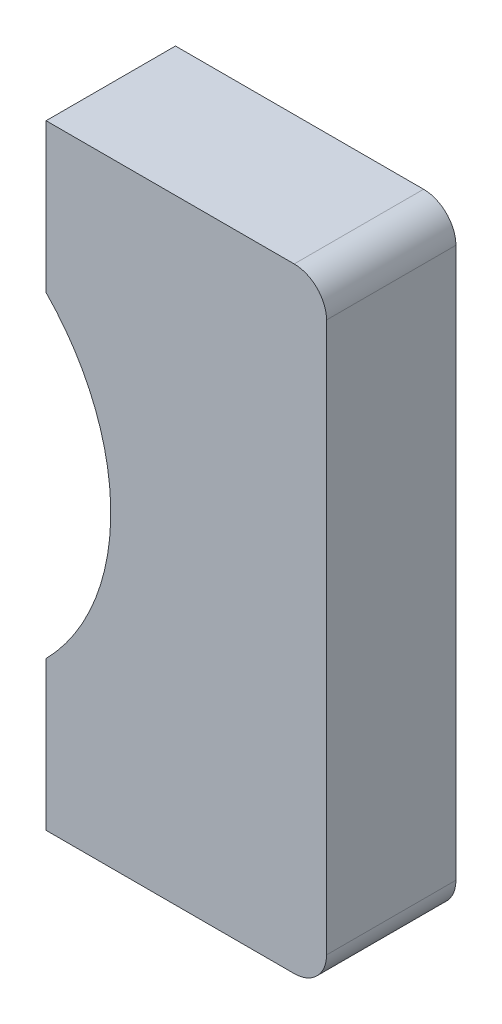
ISO-10303-21;
HEADER;
FILE_DESCRIPTION(('STEP AP214'),'2;1');
FILE_NAME('part.step','',(''),(''),'','','');
FILE_SCHEMA(('AUTOMOTIVE_DESIGN { 1 0 10303 214 1 1 1 1 }'));
ENDSEC;
DATA;
#1=APPLICATION_CONTEXT('core data for automotive mechanical design processes');
#2=APPLICATION_PROTOCOL_DEFINITION('international standard','automotive_design',2000,#1);
#3=PRODUCT_CONTEXT('',#1,'mechanical');
#4=PRODUCT('Part','Part','',(#3));
#5=PRODUCT_RELATED_PRODUCT_CATEGORY('part','',(#4));
#6=PRODUCT_DEFINITION_FORMATION('','',#4);
#7=PRODUCT_DEFINITION_CONTEXT('part definition',#1,'design');
#8=PRODUCT_DEFINITION('design','',#6,#7);
#9=PRODUCT_DEFINITION_SHAPE('','',#8);
#10=(LENGTH_UNIT() NAMED_UNIT(*) SI_UNIT(.MILLI.,.METRE.));
#11=(NAMED_UNIT(*) PLANE_ANGLE_UNIT() SI_UNIT($,.RADIAN.));
#12=(NAMED_UNIT(*) SI_UNIT($,.STERADIAN.) SOLID_ANGLE_UNIT());
#13=UNCERTAINTY_MEASURE_WITH_UNIT(LENGTH_MEASURE(1.E-05),#10,'distance_accuracy_value','');
#14=(GEOMETRIC_REPRESENTATION_CONTEXT(3) GLOBAL_UNCERTAINTY_ASSIGNED_CONTEXT((#13)) GLOBAL_UNIT_ASSIGNED_CONTEXT((#10,
#11,#12)) REPRESENTATION_CONTEXT('',''));
#15=CARTESIAN_POINT('',(0.,0.,0.));
#16=DIRECTION('',(0.,0.,1.));
#17=DIRECTION('',(1.,0.,0.));
#18=AXIS2_PLACEMENT_3D('',#15,#16,#17);
#19=CARTESIAN_POINT('',(7.21606200098991,-0.126876069111276,2.));
#20=DIRECTION('',(-1.,0.,0.));
#21=DIRECTION('',(0.,-1.,-4.37113882867379E-08));
#22=AXIS2_PLACEMENT_3D('',#19,#20,#21);
#23=PLANE('',#22);
#24=DIRECTION('',(0.,0.999999999999999,4.37113882867379E-08));
#25=VECTOR('',#24,1.);
#26=CARTESIAN_POINT('',(7.21606200098992,-4.3768759816885,-1.85773400218636E-07));
#27=LINE('',#26,#25);
#28=CARTESIAN_POINT('',(7.21606200098991,-4.3768759816885,-1.85773400218636E-07));
#29=VERTEX_POINT('',#28);
#30=CARTESIAN_POINT('',(7.21606200098991,4.1231240183115,1.85773400218636E-07));
#31=VERTEX_POINT('',#30);
#32=EDGE_CURVE('E11',#29,#31,#27,.T.);
#33=ORIENTED_EDGE('',*,*,#32,.T.);
#34=DIRECTION('',(0.,4.37113882867379E-08,-0.999999999999999));
#35=VECTOR('',#34,1.);
#36=CARTESIAN_POINT('',(7.21606200098991,4.12312393088872,2.0000001857734));
#37=LINE('',#36,#35);
#38=CARTESIAN_POINT('',(7.21606200098991,4.12312393088872,2.0000001857734));
#39=VERTEX_POINT('',#38);
#40=EDGE_CURVE('E146',#39,#31,#37,.T.);
#41=ORIENTED_EDGE('',*,*,#40,.F.);
#42=DIRECTION('',(0.,0.999999999999999,4.37113882867379E-08));
#43=VECTOR('',#42,1.);
#44=CARTESIAN_POINT('',(7.21606200098992,-4.37687606911128,1.9999998142266));
#45=LINE('',#44,#43);
#46=CARTESIAN_POINT('',(7.21606200098991,-4.37687606911128,1.9999998142266));
#47=VERTEX_POINT('',#46);
#48=EDGE_CURVE('E140',#47,#39,#45,.T.);
#49=ORIENTED_EDGE('',*,*,#48,.F.);
#50=DIRECTION('',(0.,4.37113882867379E-08,-0.999999999999999));
#51=VECTOR('',#50,1.);
#52=CARTESIAN_POINT('',(7.21606200098991,-4.37687606911128,1.9999998142266));
#53=LINE('',#52,#51);
#54=EDGE_CURVE('E97',#47,#29,#53,.T.);
#55=ORIENTED_EDGE('',*,*,#54,.T.);
#56=EDGE_LOOP('',(#33,#41,#49,#55));
#57=FACE_BOUND('',#56,.T.);
#58=ADVANCED_FACE('F17',(#57),#23,.F.);
#59=CARTESIAN_POINT('',(6.71606200098991,4.12312393088872,2.0000001857734));
#60=DIRECTION('',(0.,4.37113882867379E-08,-1.));
#61=DIRECTION('',(0.,1.,4.37113882867379E-08));
#62=AXIS2_PLACEMENT_3D('',#59,#60,#61);
#63=CYLINDRICAL_SURFACE('',#62,0.5);
#64=CARTESIAN_POINT('',(6.71606200098991,4.1231240183115,1.85773400218636E-07));
#65=DIRECTION('',(0.,-4.37113882867379E-08,1.));
#66=DIRECTION('',(1.,0.,0.));
#67=AXIS2_PLACEMENT_3D('',#64,#65,#66);
#68=CIRCLE('',#67,0.5);
#69=CARTESIAN_POINT('',(6.71606200098991,4.6231240183115,2.07629094362005E-07));
#70=VERTEX_POINT('',#69);
#71=EDGE_CURVE('E24',#31,#70,#68,.T.);
#72=ORIENTED_EDGE('',*,*,#71,.T.);
#73=DIRECTION('',(0.,4.37113882867379E-08,-0.999999999999999));
#74=VECTOR('',#73,1.);
#75=CARTESIAN_POINT('',(6.71606200098991,4.62312393088872,2.00000020762909));
#76=LINE('',#75,#74);
#77=CARTESIAN_POINT('',(6.71606200098991,4.62312393088872,2.00000020762909));
#78=VERTEX_POINT('',#77);
#79=EDGE_CURVE('E142',#78,#70,#76,.T.);
#80=ORIENTED_EDGE('',*,*,#79,.F.);
#81=CARTESIAN_POINT('',(6.71606200098991,4.12312393088872,2.0000001857734));
#82=DIRECTION('',(0.,-4.37113882867379E-08,1.));
#83=DIRECTION('',(1.,0.,0.));
#84=AXIS2_PLACEMENT_3D('',#81,#82,#83);
#85=CIRCLE('',#84,0.5);
#86=EDGE_CURVE('E132',#39,#78,#85,.T.);
#87=ORIENTED_EDGE('',*,*,#86,.F.);
#88=ORIENTED_EDGE('',*,*,#40,.T.);
#89=EDGE_LOOP('',(#72,#80,#87,#88));
#90=FACE_BOUND('',#89,.T.);
#91=ADVANCED_FACE('F148',(#90),#63,.T.);
#92=CARTESIAN_POINT('',(0.381062000989914,4.62312393088872,2.00000020762909));
#93=DIRECTION('',(0.,-1.,-4.37113882867379E-08));
#94=DIRECTION('',(1.,0.,0.));
#95=AXIS2_PLACEMENT_3D('',#92,#93,#94);
#96=PLANE('',#95);
#97=DIRECTION('',(-1.,0.,0.));
#98=VECTOR('',#97,1.);
#99=CARTESIAN_POINT('',(6.71606200098991,4.6231240183115,2.07629094362005E-07));
#100=LINE('',#99,#98);
#101=CARTESIAN_POINT('',(2.88106200098991,4.6231240183115,2.07629094362005E-07));
#102=VERTEX_POINT('',#101);
#103=EDGE_CURVE('E144',#70,#102,#100,.T.);
#104=ORIENTED_EDGE('',*,*,#103,.T.);
#105=DIRECTION('',(0.,4.37113882867379E-08,-0.999999999999999));
#106=VECTOR('',#105,1.);
#107=CARTESIAN_POINT('',(2.88106200098991,4.62312393088872,2.00000020762909));
#108=LINE('',#107,#106);
#109=CARTESIAN_POINT('',(2.88106200098991,4.62312393088872,2.00000020762909));
#110=VERTEX_POINT('',#109);
#111=EDGE_CURVE('E135',#110,#102,#108,.T.);
#112=ORIENTED_EDGE('',*,*,#111,.F.);
#113=DIRECTION('',(-1.,0.,0.));
#114=VECTOR('',#113,1.);
#115=CARTESIAN_POINT('',(6.71606200098991,4.62312393088872,2.00000020762909));
#116=LINE('',#115,#114);
#117=EDGE_CURVE('E122',#78,#110,#116,.T.);
#118=ORIENTED_EDGE('',*,*,#117,.F.);
#119=ORIENTED_EDGE('',*,*,#79,.T.);
#120=EDGE_LOOP('',(#104,#112,#118,#119));
#121=FACE_BOUND('',#120,.T.);
#122=ADVANCED_FACE('F154',(#121),#96,.F.);
#123=CARTESIAN_POINT('',(2.88106200098991,-0.126876069111276,2.));
#124=DIRECTION('',(1.,0.,0.));
#125=DIRECTION('',(0.,1.,4.37113882867379E-08));
#126=AXIS2_PLACEMENT_3D('',#123,#124,#125);
#127=PLANE('',#126);
#128=DIRECTION('',(0.,-0.999999999999999,-4.37113882867379E-08));
#129=VECTOR('',#128,1.);
#130=CARTESIAN_POINT('',(2.88106200098991,4.6231240183115,2.07629094362005E-07));
#131=LINE('',#130,#129);
#132=CARTESIAN_POINT('',(2.88106200098991,2.3226137610945,1.0707059725117E-07));
#133=VERTEX_POINT('',#132);
#134=EDGE_CURVE('E138',#102,#133,#131,.T.);
#135=ORIENTED_EDGE('',*,*,#134,.T.);
#136=DIRECTION('',(0.,4.37113882867379E-08,-0.999999999999999));
#137=VECTOR('',#136,1.);
#138=CARTESIAN_POINT('',(2.88106200098991,2.32261367367172,2.0000001070706));
#139=LINE('',#138,#137);
#140=CARTESIAN_POINT('',(2.88106200098991,2.32261367367172,2.0000001070706));
#141=VERTEX_POINT('',#140);
#142=EDGE_CURVE('E125',#141,#133,#139,.T.);
#143=ORIENTED_EDGE('',*,*,#142,.F.);
#144=DIRECTION('',(0.,-0.999999999999999,-4.37113882754165E-08));
#145=VECTOR('',#144,1.);
#146=CARTESIAN_POINT('',(2.88106200098991,4.62312393088872,2.00000020762909));
#147=LINE('',#146,#145);
#148=EDGE_CURVE('E114',#110,#141,#147,.T.);
#149=ORIENTED_EDGE('',*,*,#148,.F.);
#150=ORIENTED_EDGE('',*,*,#111,.T.);
#151=EDGE_LOOP('',(#135,#143,#149,#150));
#152=FACE_BOUND('',#151,.T.);
#153=ADVANCED_FACE('F158',(#152),#127,.F.);
#154=CARTESIAN_POINT('',(0.38106200098991,-0.126876069111276,2.));
#155=DIRECTION('',(0.,4.37113882867379E-08,-1.));
#156=DIRECTION('',(0.,1.,4.37113882867379E-08));
#157=AXIS2_PLACEMENT_3D('',#154,#155,#156);
#158=CYLINDRICAL_SURFACE('',#157,3.5);
#159=CARTESIAN_POINT('',(0.38106200098991,-0.126875981688499,0.));
#160=DIRECTION('',(0.,-4.37113882867379E-08,1.));
#161=DIRECTION('',(0.71428571428574,-0.699854212223739,-3.05915992146209E-08));
#162=AXIS2_PLACEMENT_3D('',#159,#160,#161);
#163=CIRCLE('',#162,3.5);
#164=CARTESIAN_POINT('',(2.88106200098991,-2.5763657244715,-1.0707059725117E-07));
#165=VERTEX_POINT('',#164);
#166=EDGE_CURVE('E128',#165,#133,#163,.T.);
#167=ORIENTED_EDGE('',*,*,#166,.F.);
#168=DIRECTION('',(0.,4.37113882867379E-08,-0.999999999999999));
#169=VECTOR('',#168,1.);
#170=CARTESIAN_POINT('',(2.88106200098991,-2.57636581189428,1.9999998929294));
#171=LINE('',#170,#169);
#172=CARTESIAN_POINT('',(2.88106200098991,-2.57636581189428,1.9999998929294));
#173=VERTEX_POINT('',#172);
#174=EDGE_CURVE('E117',#173,#165,#171,.T.);
#175=ORIENTED_EDGE('',*,*,#174,.F.);
#176=CARTESIAN_POINT('',(0.38106200098991,-0.126876069111276,2.));
#177=DIRECTION('',(0.,-4.37113882867379E-08,1.));
#178=DIRECTION('',(0.71428571428574,-0.699854212223739,-3.05915992146209E-08));
#179=AXIS2_PLACEMENT_3D('',#176,#177,#178);
#180=CIRCLE('',#179,3.5);
#181=EDGE_CURVE('E108',#173,#141,#180,.T.);
#182=ORIENTED_EDGE('',*,*,#181,.T.);
#183=ORIENTED_EDGE('',*,*,#142,.T.);
#184=EDGE_LOOP('',(#167,#175,#182,#183));
#185=FACE_BOUND('',#184,.T.);
#186=ADVANCED_FACE('F163',(#185),#158,.F.);
#187=CARTESIAN_POINT('',(2.88106200098991,-0.126876069111276,2.));
#188=DIRECTION('',(1.,0.,0.));
#189=DIRECTION('',(0.,1.,4.37113882867379E-08));
#190=AXIS2_PLACEMENT_3D('',#187,#188,#189);
#191=PLANE('',#190);
#192=DIRECTION('',(0.,-0.999999999999999,-4.37113882867379E-08));
#193=VECTOR('',#192,1.);
#194=CARTESIAN_POINT('',(2.88106200098991,-2.5763657244715,-1.0707059725117E-07));
#195=LINE('',#194,#193);
#196=CARTESIAN_POINT('',(2.88106200098991,-4.8768759816885,-2.07629094362005E-07));
#197=VERTEX_POINT('',#196);
#198=EDGE_CURVE('E120',#165,#197,#195,.T.);
#199=ORIENTED_EDGE('',*,*,#198,.T.);
#200=DIRECTION('',(0.,4.37113882867379E-08,-0.999999999999999));
#201=VECTOR('',#200,1.);
#202=CARTESIAN_POINT('',(2.88106200098991,-4.87687606911128,1.99999979237091));
#203=LINE('',#202,#201);
#204=CARTESIAN_POINT('',(2.88106200098991,-4.87687606911128,1.99999979237091));
#205=VERTEX_POINT('',#204);
#206=EDGE_CURVE('E111',#205,#197,#203,.T.);
#207=ORIENTED_EDGE('',*,*,#206,.F.);
#208=DIRECTION('',(0.,-0.999999999999999,-4.37113882754165E-08));
#209=VECTOR('',#208,1.);
#210=CARTESIAN_POINT('',(2.88106200098991,-2.57636581189428,1.9999998929294));
#211=LINE('',#210,#209);
#212=EDGE_CURVE('E91',#173,#205,#211,.T.);
#213=ORIENTED_EDGE('',*,*,#212,.F.);
#214=ORIENTED_EDGE('',*,*,#174,.T.);
#215=EDGE_LOOP('',(#199,#207,#213,#214));
#216=FACE_BOUND('',#215,.T.);
#217=ADVANCED_FACE('F161',(#216),#191,.F.);
#218=CARTESIAN_POINT('',(0.381062000989914,-4.87687606911128,1.99999979237091));
#219=DIRECTION('',(0.,-1.,-4.37113882867379E-08));
#220=DIRECTION('',(1.,0.,0.));
#221=AXIS2_PLACEMENT_3D('',#218,#219,#220);
#222=PLANE('',#221);
#223=DIRECTION('',(-1.,0.,0.));
#224=VECTOR('',#223,1.);
#225=CARTESIAN_POINT('',(6.71606200098991,-4.87687598168849,-2.07629094362005E-07));
#226=LINE('',#225,#224);
#227=CARTESIAN_POINT('',(6.71606200098991,-4.8768759816885,-2.07629094362005E-07));
#228=VERTEX_POINT('',#227);
#229=EDGE_CURVE('E86',#228,#197,#226,.T.);
#230=ORIENTED_EDGE('',*,*,#229,.F.);
#231=DIRECTION('',(0.,4.37113882867379E-08,-0.999999999999999));
#232=VECTOR('',#231,1.);
#233=CARTESIAN_POINT('',(6.71606200098991,-4.87687606911128,1.99999979237091));
#234=LINE('',#233,#232);
#235=CARTESIAN_POINT('',(6.71606200098991,-4.87687606911128,1.99999979237091));
#236=VERTEX_POINT('',#235);
#237=EDGE_CURVE('E78',#236,#228,#234,.T.);
#238=ORIENTED_EDGE('',*,*,#237,.F.);
#239=DIRECTION('',(-1.,0.,0.));
#240=VECTOR('',#239,1.);
#241=CARTESIAN_POINT('',(6.71606200098991,-4.87687606911127,1.99999979237091));
#242=LINE('',#241,#240);
#243=EDGE_CURVE('E83',#236,#205,#242,.T.);
#244=ORIENTED_EDGE('',*,*,#243,.T.);
#245=ORIENTED_EDGE('',*,*,#206,.T.);
#246=EDGE_LOOP('',(#230,#238,#244,#245));
#247=FACE_BOUND('',#246,.T.);
#248=ADVANCED_FACE('F80',(#247),#222,.T.);
#249=CARTESIAN_POINT('',(6.71606200098991,-4.37687606911128,1.9999998142266));
#250=DIRECTION('',(0.,4.37113882867379E-08,-1.));
#251=DIRECTION('',(0.,1.,4.37113882867379E-08));
#252=AXIS2_PLACEMENT_3D('',#249,#250,#251);
#253=CYLINDRICAL_SURFACE('',#252,0.5);
#254=CARTESIAN_POINT('',(6.71606200098991,-4.3768759816885,-1.85773400218636E-07));
#255=DIRECTION('',(0.,4.37113882867379E-08,-1.));
#256=DIRECTION('',(1.,0.,0.));
#257=AXIS2_PLACEMENT_3D('',#254,#255,#256);
#258=CIRCLE('',#257,0.5);
#259=EDGE_CURVE('E90',#29,#228,#258,.T.);
#260=ORIENTED_EDGE('',*,*,#259,.F.);
#261=ORIENTED_EDGE('',*,*,#54,.F.);
#262=CARTESIAN_POINT('',(6.71606200098991,-4.37687606911128,1.9999998142266));
#263=DIRECTION('',(0.,4.37113882867379E-08,-1.));
#264=DIRECTION('',(1.,0.,0.));
#265=AXIS2_PLACEMENT_3D('',#262,#263,#264);
#266=CIRCLE('',#265,0.5);
#267=EDGE_CURVE('E95',#47,#236,#266,.T.);
#268=ORIENTED_EDGE('',*,*,#267,.T.);
#269=ORIENTED_EDGE('',*,*,#237,.T.);
#270=EDGE_LOOP('',(#260,#261,#268,#269));
#271=FACE_BOUND('',#270,.T.);
#272=ADVANCED_FACE('F96',(#271),#253,.T.);
#273=CARTESIAN_POINT('',(0.381062000989914,-0.126876069111276,2.));
#274=DIRECTION('',(0.,-4.37113882867379E-08,1.));
#275=DIRECTION('',(0.,-1.,-4.37113882867379E-08));
#276=AXIS2_PLACEMENT_3D('',#273,#274,#275);
#277=PLANE('',#276);
#278=ORIENTED_EDGE('',*,*,#48,.T.);
#279=ORIENTED_EDGE('',*,*,#86,.T.);
#280=ORIENTED_EDGE('',*,*,#117,.T.);
#281=ORIENTED_EDGE('',*,*,#148,.T.);
#282=ORIENTED_EDGE('',*,*,#181,.F.);
#283=ORIENTED_EDGE('',*,*,#212,.T.);
#284=ORIENTED_EDGE('',*,*,#243,.F.);
#285=ORIENTED_EDGE('',*,*,#267,.F.);
#286=EDGE_LOOP('',(#278,#279,#280,#281,#282,#283,#284,#285));
#287=FACE_BOUND('',#286,.T.);
#288=ADVANCED_FACE('F101',(#287),#277,.T.);
#289=CARTESIAN_POINT('',(0.381062000989914,-0.126875981688499,0.));
#290=DIRECTION('',(0.,-4.37113882867379E-08,1.));
#291=DIRECTION('',(0.,-1.,-4.37113882867379E-08));
#292=AXIS2_PLACEMENT_3D('',#289,#290,#291);
#293=PLANE('',#292);
#294=ORIENTED_EDGE('',*,*,#32,.F.);
#295=ORIENTED_EDGE('',*,*,#259,.T.);
#296=ORIENTED_EDGE('',*,*,#229,.T.);
#297=ORIENTED_EDGE('',*,*,#198,.F.);
#298=ORIENTED_EDGE('',*,*,#166,.T.);
#299=ORIENTED_EDGE('',*,*,#134,.F.);
#300=ORIENTED_EDGE('',*,*,#103,.F.);
#301=ORIENTED_EDGE('',*,*,#71,.F.);
#302=EDGE_LOOP('',(#294,#295,#296,#297,#298,#299,#300,#301));
#303=FACE_BOUND('',#302,.T.);
#304=ADVANCED_FACE('F151',(#303),#293,.F.);
#305=CLOSED_SHELL('',(#58,#91,#122,#153,#186,#217,#248,#272,#288,#304));
#306=MANIFOLD_SOLID_BREP('B1',#305);
#307=ADVANCED_BREP_SHAPE_REPRESENTATION('',(#18,#306),#14);
#308=SHAPE_DEFINITION_REPRESENTATION(#9,#307);
ENDSEC;
END-ISO-10303-21;
